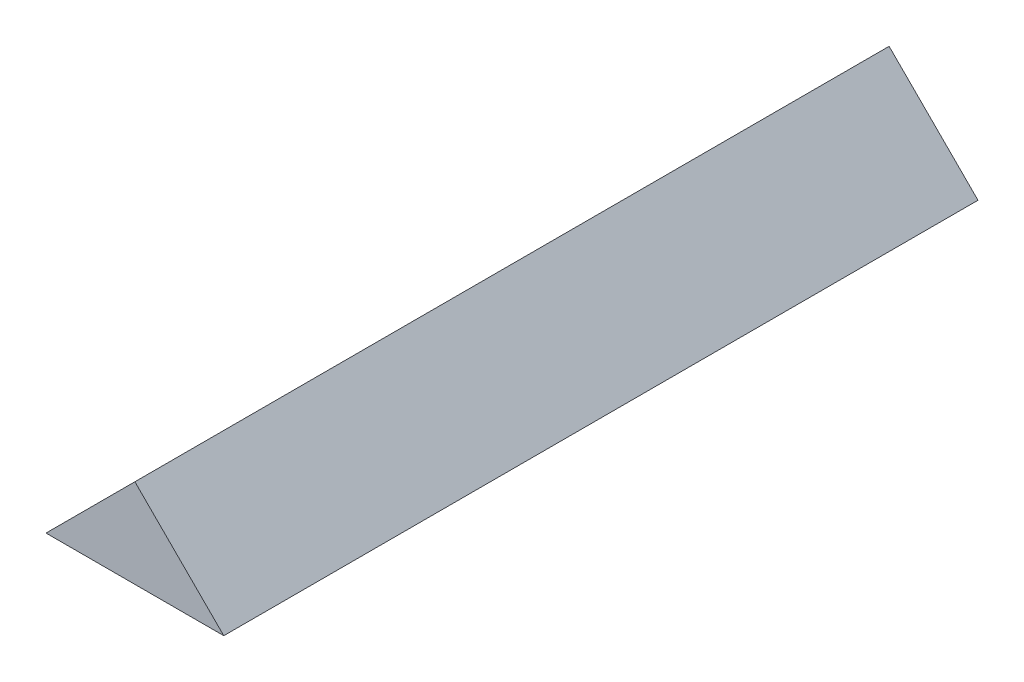
ISO-10303-21;
HEADER;
FILE_DESCRIPTION(('STEP AP214'),'2;1');
FILE_NAME('part.step','',(''),(''),'','','');
FILE_SCHEMA(('AUTOMOTIVE_DESIGN { 1 0 10303 214 1 1 1 1 }'));
ENDSEC;
DATA;
#1=APPLICATION_CONTEXT('core data for automotive mechanical design processes');
#2=APPLICATION_PROTOCOL_DEFINITION('international standard','automotive_design',2000,#1);
#3=PRODUCT_CONTEXT('',#1,'mechanical');
#4=PRODUCT('Part','Part','',(#3));
#5=PRODUCT_RELATED_PRODUCT_CATEGORY('part','',(#4));
#6=PRODUCT_DEFINITION_FORMATION('','',#4);
#7=PRODUCT_DEFINITION_CONTEXT('part definition',#1,'design');
#8=PRODUCT_DEFINITION('design','',#6,#7);
#9=PRODUCT_DEFINITION_SHAPE('','',#8);
#10=(LENGTH_UNIT() NAMED_UNIT(*) SI_UNIT(.MILLI.,.METRE.));
#11=(NAMED_UNIT(*) PLANE_ANGLE_UNIT() SI_UNIT($,.RADIAN.));
#12=(NAMED_UNIT(*) SI_UNIT($,.STERADIAN.) SOLID_ANGLE_UNIT());
#13=UNCERTAINTY_MEASURE_WITH_UNIT(LENGTH_MEASURE(1.E-05),#10,'distance_accuracy_value','');
#14=(GEOMETRIC_REPRESENTATION_CONTEXT(3) GLOBAL_UNCERTAINTY_ASSIGNED_CONTEXT((#13)) GLOBAL_UNIT_ASSIGNED_CONTEXT((#10,
#11,#12)) REPRESENTATION_CONTEXT('',''));
#15=CARTESIAN_POINT('',(0.,0.,0.));
#16=DIRECTION('',(0.,0.,1.));
#17=DIRECTION('',(1.,0.,0.));
#18=AXIS2_PLACEMENT_3D('',#15,#16,#17);
#19=CARTESIAN_POINT('',(-17.6776695296637,17.6776695296637,150.));
#20=DIRECTION('',(-0.707106781186549,-0.707106781186546,0.));
#21=DIRECTION('',(0.707106781186546,-0.707106781186549,0.));
#22=AXIS2_PLACEMENT_3D('',#19,#20,#21);
#23=PLANE('',#22);
#24=DIRECTION('',(-0.707106781186546,0.707106781186549,0.));
#25=VECTOR('',#24,1.);
#26=CARTESIAN_POINT('',(-17.6776695296637,17.6776695296637,0.));
#27=LINE('',#26,#25);
#28=CARTESIAN_POINT('',(0.,0.,0.));
#29=VERTEX_POINT('',#28);
#30=CARTESIAN_POINT('',(-17.6776695296637,17.6776695296637,0.));
#31=VERTEX_POINT('',#30);
#32=EDGE_CURVE('E89',#29,#31,#27,.T.);
#33=ORIENTED_EDGE('',*,*,#32,.T.);
#34=DIRECTION('',(0.,0.,-1.));
#35=VECTOR('',#34,1.);
#36=CARTESIAN_POINT('',(-17.6776695296637,17.6776695296637,150.));
#37=LINE('',#36,#35);
#38=CARTESIAN_POINT('',(-17.6776695296637,17.6776695296637,150.));
#39=VERTEX_POINT('',#38);
#40=EDGE_CURVE('E11',#39,#31,#37,.T.);
#41=ORIENTED_EDGE('',*,*,#40,.F.);
#42=DIRECTION('',(-0.707106781186546,0.707106781186549,0.));
#43=VECTOR('',#42,1.);
#44=CARTESIAN_POINT('',(-17.6776695296637,17.6776695296637,150.));
#45=LINE('',#44,#43);
#46=CARTESIAN_POINT('',(0.,0.,150.));
#47=VERTEX_POINT('',#46);
#48=EDGE_CURVE('E81',#47,#39,#45,.T.);
#49=ORIENTED_EDGE('',*,*,#48,.F.);
#50=DIRECTION('',(0.,0.,-1.));
#51=VECTOR('',#50,1.);
#52=CARTESIAN_POINT('',(0.,0.,150.));
#53=LINE('',#52,#51);
#54=EDGE_CURVE('E90',#47,#29,#53,.T.);
#55=ORIENTED_EDGE('',*,*,#54,.T.);
#56=EDGE_LOOP('',(#33,#41,#49,#55));
#57=FACE_BOUND('',#56,.T.);
#58=ADVANCED_FACE('F39',(#57),#23,.F.);
#59=CARTESIAN_POINT('',(-35.3553390593273,0.,150.));
#60=DIRECTION('',(0.707106781186549,-0.707106781186546,0.));
#61=DIRECTION('',(0.707106781186546,0.707106781186549,0.));
#62=AXIS2_PLACEMENT_3D('',#59,#60,#61);
#63=PLANE('',#62);
#64=DIRECTION('',(-0.707106781186546,-0.707106781186549,0.));
#65=VECTOR('',#64,1.);
#66=CARTESIAN_POINT('',(-35.3553390593273,0.,0.));
#67=LINE('',#66,#65);
#68=CARTESIAN_POINT('',(-35.3553390593273,0.,0.));
#69=VERTEX_POINT('',#68);
#70=EDGE_CURVE('E68',#31,#69,#67,.T.);
#71=ORIENTED_EDGE('',*,*,#70,.T.);
#72=DIRECTION('',(0.,0.,-1.));
#73=VECTOR('',#72,1.);
#74=CARTESIAN_POINT('',(-35.3553390593273,0.,150.));
#75=LINE('',#74,#73);
#76=CARTESIAN_POINT('',(-35.3553390593273,0.,150.));
#77=VERTEX_POINT('',#76);
#78=EDGE_CURVE('E48',#77,#69,#75,.T.);
#79=ORIENTED_EDGE('',*,*,#78,.F.);
#80=DIRECTION('',(-0.707106781186546,-0.707106781186549,0.));
#81=VECTOR('',#80,1.);
#82=CARTESIAN_POINT('',(-35.3553390593273,0.,150.));
#83=LINE('',#82,#81);
#84=EDGE_CURVE('E76',#39,#77,#83,.T.);
#85=ORIENTED_EDGE('',*,*,#84,.F.);
#86=ORIENTED_EDGE('',*,*,#40,.T.);
#87=EDGE_LOOP('',(#71,#79,#85,#86));
#88=FACE_BOUND('',#87,.T.);
#89=ADVANCED_FACE('F77',(#88),#63,.F.);
#90=CARTESIAN_POINT('',(0.,0.,150.));
#91=DIRECTION('',(0.,1.,0.));
#92=DIRECTION('',(-1.,0.,0.));
#93=AXIS2_PLACEMENT_3D('',#90,#91,#92);
#94=PLANE('',#93);
#95=DIRECTION('',(1.,0.,0.));
#96=VECTOR('',#95,1.);
#97=CARTESIAN_POINT('',(0.,0.,0.));
#98=LINE('',#97,#96);
#99=EDGE_CURVE('E73',#69,#29,#98,.T.);
#100=ORIENTED_EDGE('',*,*,#99,.T.);
#101=ORIENTED_EDGE('',*,*,#54,.F.);
#102=DIRECTION('',(1.,0.,0.));
#103=VECTOR('',#102,1.);
#104=CARTESIAN_POINT('',(0.,0.,150.));
#105=LINE('',#104,#103);
#106=EDGE_CURVE('E56',#77,#47,#105,.T.);
#107=ORIENTED_EDGE('',*,*,#106,.F.);
#108=ORIENTED_EDGE('',*,*,#78,.T.);
#109=EDGE_LOOP('',(#100,#101,#107,#108));
#110=FACE_BOUND('',#109,.T.);
#111=ADVANCED_FACE('F102',(#110),#94,.F.);
#112=CARTESIAN_POINT('',(0.,0.,150.));
#113=DIRECTION('',(0.,0.,1.));
#114=DIRECTION('',(1.,0.,0.));
#115=AXIS2_PLACEMENT_3D('',#112,#113,#114);
#116=PLANE('',#115);
#117=ORIENTED_EDGE('',*,*,#48,.T.);
#118=ORIENTED_EDGE('',*,*,#84,.T.);
#119=ORIENTED_EDGE('',*,*,#106,.T.);
#120=EDGE_LOOP('',(#117,#118,#119));
#121=FACE_BOUND('',#120,.T.);
#122=ADVANCED_FACE('F84',(#121),#116,.T.);
#123=CARTESIAN_POINT('',(0.,0.,0.));
#124=DIRECTION('',(0.,0.,1.));
#125=DIRECTION('',(1.,0.,0.));
#126=AXIS2_PLACEMENT_3D('',#123,#124,#125);
#127=PLANE('',#126);
#128=ORIENTED_EDGE('',*,*,#32,.F.);
#129=ORIENTED_EDGE('',*,*,#99,.F.);
#130=ORIENTED_EDGE('',*,*,#70,.F.);
#131=EDGE_LOOP('',(#128,#129,#130));
#132=FACE_BOUND('',#131,.T.);
#133=ADVANCED_FACE('F103',(#132),#127,.F.);
#134=CLOSED_SHELL('',(#58,#89,#111,#122,#133));
#135=MANIFOLD_SOLID_BREP('B2',#134);
#136=ADVANCED_BREP_SHAPE_REPRESENTATION('',(#18,#135),#14);
#137=SHAPE_DEFINITION_REPRESENTATION(#9,#136);
ENDSEC;
END-ISO-10303-21;
